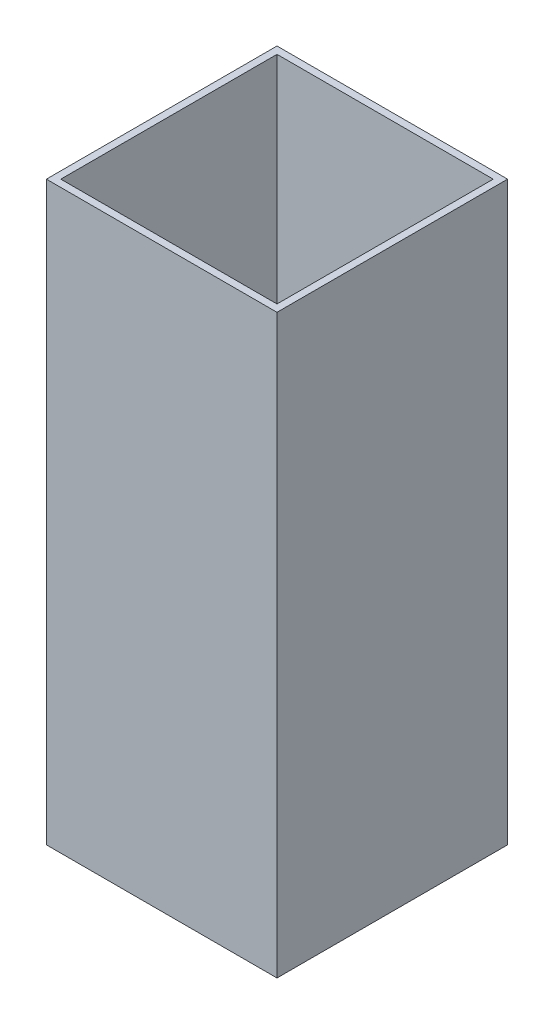
ISO-10303-21;
HEADER;
FILE_DESCRIPTION(('STEP AP214'),'2;1');
FILE_NAME('part.step','',(''),(''),'','','');
FILE_SCHEMA(('AUTOMOTIVE_DESIGN { 1 0 10303 214 1 1 1 1 }'));
ENDSEC;
DATA;
#1=APPLICATION_CONTEXT('core data for automotive mechanical design processes');
#2=APPLICATION_PROTOCOL_DEFINITION('international standard','automotive_design',2000,#1);
#3=PRODUCT_CONTEXT('',#1,'mechanical');
#4=PRODUCT('Part','Part','',(#3));
#5=PRODUCT_RELATED_PRODUCT_CATEGORY('part','',(#4));
#6=PRODUCT_DEFINITION_FORMATION('','',#4);
#7=PRODUCT_DEFINITION_CONTEXT('part definition',#1,'design');
#8=PRODUCT_DEFINITION('design','',#6,#7);
#9=PRODUCT_DEFINITION_SHAPE('','',#8);
#10=(LENGTH_UNIT() NAMED_UNIT(*) SI_UNIT(.MILLI.,.METRE.));
#11=(NAMED_UNIT(*) PLANE_ANGLE_UNIT() SI_UNIT($,.RADIAN.));
#12=(NAMED_UNIT(*) SI_UNIT($,.STERADIAN.) SOLID_ANGLE_UNIT());
#13=UNCERTAINTY_MEASURE_WITH_UNIT(LENGTH_MEASURE(1.E-05),#10,'distance_accuracy_value','');
#14=(GEOMETRIC_REPRESENTATION_CONTEXT(3) GLOBAL_UNCERTAINTY_ASSIGNED_CONTEXT((#13)) GLOBAL_UNIT_ASSIGNED_CONTEXT((#10,
#11,#12)) REPRESENTATION_CONTEXT('',''));
#15=CARTESIAN_POINT('',(0.,0.,0.));
#16=DIRECTION('',(0.,0.,1.));
#17=DIRECTION('',(1.,0.,0.));
#18=AXIS2_PLACEMENT_3D('',#15,#16,#17);
#19=CARTESIAN_POINT('',(0.,40.,0.));
#20=DIRECTION('',(0.,1.,0.));
#21=DIRECTION('',(0.,0.,1.));
#22=AXIS2_PLACEMENT_3D('',#19,#20,#21);
#23=PLANE('',#22);
#24=DIRECTION('',(-1.,0.,0.));
#25=VECTOR('',#24,1.);
#26=CARTESIAN_POINT('',(16.,40.,-16.));
#27=LINE('',#26,#25);
#28=CARTESIAN_POINT('',(16.,40.,-16.));
#29=VERTEX_POINT('',#28);
#30=CARTESIAN_POINT('',(-16.,40.,-16.));
#31=VERTEX_POINT('',#30);
#32=EDGE_CURVE('E135',#29,#31,#27,.T.);
#33=ORIENTED_EDGE('',*,*,#32,.T.);
#34=DIRECTION('',(0.,0.,1.));
#35=VECTOR('',#34,1.);
#36=CARTESIAN_POINT('',(-16.,40.,-16.));
#37=LINE('',#36,#35);
#38=CARTESIAN_POINT('',(-16.,40.,16.));
#39=VERTEX_POINT('',#38);
#40=EDGE_CURVE('E138',#31,#39,#37,.T.);
#41=ORIENTED_EDGE('',*,*,#40,.T.);
#42=DIRECTION('',(1.,0.,0.));
#43=VECTOR('',#42,1.);
#44=CARTESIAN_POINT('',(16.,40.,16.));
#45=LINE('',#44,#43);
#46=CARTESIAN_POINT('',(16.,40.,16.));
#47=VERTEX_POINT('',#46);
#48=EDGE_CURVE('E141',#39,#47,#45,.T.);
#49=ORIENTED_EDGE('',*,*,#48,.T.);
#50=DIRECTION('',(0.,0.,-1.));
#51=VECTOR('',#50,1.);
#52=CARTESIAN_POINT('',(16.,40.,-16.));
#53=LINE('',#52,#51);
#54=EDGE_CURVE('E143',#47,#29,#53,.T.);
#55=ORIENTED_EDGE('',*,*,#54,.T.);
#56=EDGE_LOOP('',(#33,#41,#49,#55));
#57=FACE_BOUND('',#56,.T.);
#58=DIRECTION('',(1.,0.,0.));
#59=VECTOR('',#58,1.);
#60=CARTESIAN_POINT('',(15.,40.,15.));
#61=LINE('',#60,#59);
#62=CARTESIAN_POINT('',(-15.,40.,15.));
#63=VERTEX_POINT('',#62);
#64=CARTESIAN_POINT('',(15.,40.,15.));
#65=VERTEX_POINT('',#64);
#66=EDGE_CURVE('E107',#63,#65,#61,.T.);
#67=ORIENTED_EDGE('',*,*,#66,.F.);
#68=DIRECTION('',(0.,0.,1.));
#69=VECTOR('',#68,1.);
#70=CARTESIAN_POINT('',(-15.,40.,-15.));
#71=LINE('',#70,#69);
#72=CARTESIAN_POINT('',(-15.,40.,-15.));
#73=VERTEX_POINT('',#72);
#74=EDGE_CURVE('E99',#73,#63,#71,.T.);
#75=ORIENTED_EDGE('',*,*,#74,.F.);
#76=DIRECTION('',(-1.,0.,0.));
#77=VECTOR('',#76,1.);
#78=CARTESIAN_POINT('',(15.,40.,-15.));
#79=LINE('',#78,#77);
#80=CARTESIAN_POINT('',(15.,40.,-15.));
#81=VERTEX_POINT('',#80);
#82=EDGE_CURVE('E121',#81,#73,#79,.T.);
#83=ORIENTED_EDGE('',*,*,#82,.F.);
#84=DIRECTION('',(0.,0.,-1.));
#85=VECTOR('',#84,1.);
#86=CARTESIAN_POINT('',(15.,40.,-15.));
#87=LINE('',#86,#85);
#88=EDGE_CURVE('E119',#65,#81,#87,.T.);
#89=ORIENTED_EDGE('',*,*,#88,.F.);
#90=EDGE_LOOP('',(#67,#75,#83,#89));
#91=FACE_BOUND('',#90,.T.);
#92=ADVANCED_FACE('F34',(#57,#91),#23,.T.);
#93=CARTESIAN_POINT('',(0.,-40.,0.));
#94=DIRECTION('',(0.,1.,0.));
#95=DIRECTION('',(0.,0.,1.));
#96=AXIS2_PLACEMENT_3D('',#93,#94,#95);
#97=PLANE('',#96);
#98=DIRECTION('',(-1.,0.,0.));
#99=VECTOR('',#98,1.);
#100=CARTESIAN_POINT('',(16.,-40.,-16.));
#101=LINE('',#100,#99);
#102=CARTESIAN_POINT('',(16.,-40.,-16.));
#103=VERTEX_POINT('',#102);
#104=CARTESIAN_POINT('',(-16.,-40.,-16.));
#105=VERTEX_POINT('',#104);
#106=EDGE_CURVE('E115',#103,#105,#101,.T.);
#107=ORIENTED_EDGE('',*,*,#106,.F.);
#108=DIRECTION('',(0.,0.,-1.));
#109=VECTOR('',#108,1.);
#110=CARTESIAN_POINT('',(16.,-40.,-16.));
#111=LINE('',#110,#109);
#112=CARTESIAN_POINT('',(16.,-40.,16.));
#113=VERTEX_POINT('',#112);
#114=EDGE_CURVE('E139',#113,#103,#111,.T.);
#115=ORIENTED_EDGE('',*,*,#114,.F.);
#116=DIRECTION('',(1.,0.,0.));
#117=VECTOR('',#116,1.);
#118=CARTESIAN_POINT('',(16.,-40.,16.));
#119=LINE('',#118,#117);
#120=CARTESIAN_POINT('',(-16.,-40.,16.));
#121=VERTEX_POINT('',#120);
#122=EDGE_CURVE('E150',#121,#113,#119,.T.);
#123=ORIENTED_EDGE('',*,*,#122,.F.);
#124=DIRECTION('',(0.,0.,1.));
#125=VECTOR('',#124,1.);
#126=CARTESIAN_POINT('',(-16.,-40.,-16.));
#127=LINE('',#126,#125);
#128=EDGE_CURVE('E148',#105,#121,#127,.T.);
#129=ORIENTED_EDGE('',*,*,#128,.F.);
#130=EDGE_LOOP('',(#107,#115,#123,#129));
#131=FACE_BOUND('',#130,.T.);
#132=DIRECTION('',(0.,0.,1.));
#133=VECTOR('',#132,1.);
#134=CARTESIAN_POINT('',(-15.,-40.,-15.));
#135=LINE('',#134,#133);
#136=CARTESIAN_POINT('',(-15.,-40.,-15.));
#137=VERTEX_POINT('',#136);
#138=CARTESIAN_POINT('',(-15.,-40.,15.));
#139=VERTEX_POINT('',#138);
#140=EDGE_CURVE('E57',#137,#139,#135,.T.);
#141=ORIENTED_EDGE('',*,*,#140,.T.);
#142=DIRECTION('',(1.,0.,0.));
#143=VECTOR('',#142,1.);
#144=CARTESIAN_POINT('',(15.,-40.,15.));
#145=LINE('',#144,#143);
#146=CARTESIAN_POINT('',(15.,-40.,15.));
#147=VERTEX_POINT('',#146);
#148=EDGE_CURVE('E114',#139,#147,#145,.T.);
#149=ORIENTED_EDGE('',*,*,#148,.T.);
#150=DIRECTION('',(0.,0.,-1.));
#151=VECTOR('',#150,1.);
#152=CARTESIAN_POINT('',(15.,-40.,-15.));
#153=LINE('',#152,#151);
#154=CARTESIAN_POINT('',(15.,-40.,-15.));
#155=VERTEX_POINT('',#154);
#156=EDGE_CURVE('E127',#147,#155,#153,.T.);
#157=ORIENTED_EDGE('',*,*,#156,.T.);
#158=DIRECTION('',(-1.,0.,0.));
#159=VECTOR('',#158,1.);
#160=CARTESIAN_POINT('',(15.,-40.,-15.));
#161=LINE('',#160,#159);
#162=EDGE_CURVE('E108',#155,#137,#161,.T.);
#163=ORIENTED_EDGE('',*,*,#162,.T.);
#164=EDGE_LOOP('',(#141,#149,#157,#163));
#165=FACE_BOUND('',#164,.T.);
#166=ADVANCED_FACE('F168',(#131,#165),#97,.F.);
#167=CARTESIAN_POINT('',(16.,40.,-16.));
#168=DIRECTION('',(0.,0.,1.));
#169=DIRECTION('',(1.,0.,0.));
#170=AXIS2_PLACEMENT_3D('',#167,#168,#169);
#171=PLANE('',#170);
#172=ORIENTED_EDGE('',*,*,#106,.T.);
#173=DIRECTION('',(0.,-1.,0.));
#174=VECTOR('',#173,1.);
#175=CARTESIAN_POINT('',(-16.,40.,-16.));
#176=LINE('',#175,#174);
#177=EDGE_CURVE('E11',#31,#105,#176,.T.);
#178=ORIENTED_EDGE('',*,*,#177,.F.);
#179=ORIENTED_EDGE('',*,*,#32,.F.);
#180=DIRECTION('',(0.,-1.,0.));
#181=VECTOR('',#180,1.);
#182=CARTESIAN_POINT('',(16.,40.,-16.));
#183=LINE('',#182,#181);
#184=EDGE_CURVE('E145',#29,#103,#183,.T.);
#185=ORIENTED_EDGE('',*,*,#184,.T.);
#186=EDGE_LOOP('',(#172,#178,#179,#185));
#187=FACE_BOUND('',#186,.T.);
#188=ADVANCED_FACE('F36',(#187),#171,.F.);
#189=CARTESIAN_POINT('',(-16.,40.,-16.));
#190=DIRECTION('',(1.,0.,0.));
#191=DIRECTION('',(0.,0.,-1.));
#192=AXIS2_PLACEMENT_3D('',#189,#190,#191);
#193=PLANE('',#192);
#194=ORIENTED_EDGE('',*,*,#128,.T.);
#195=DIRECTION('',(0.,-1.,0.));
#196=VECTOR('',#195,1.);
#197=CARTESIAN_POINT('',(-16.,40.,16.));
#198=LINE('',#197,#196);
#199=EDGE_CURVE('E42',#39,#121,#198,.T.);
#200=ORIENTED_EDGE('',*,*,#199,.F.);
#201=ORIENTED_EDGE('',*,*,#40,.F.);
#202=ORIENTED_EDGE('',*,*,#177,.T.);
#203=EDGE_LOOP('',(#194,#200,#201,#202));
#204=FACE_BOUND('',#203,.T.);
#205=ADVANCED_FACE('F178',(#204),#193,.F.);
#206=CARTESIAN_POINT('',(16.,40.,16.));
#207=DIRECTION('',(0.,0.,-1.));
#208=DIRECTION('',(-1.,0.,0.));
#209=AXIS2_PLACEMENT_3D('',#206,#207,#208);
#210=PLANE('',#209);
#211=ORIENTED_EDGE('',*,*,#122,.T.);
#212=DIRECTION('',(0.,-1.,0.));
#213=VECTOR('',#212,1.);
#214=CARTESIAN_POINT('',(16.,40.,16.));
#215=LINE('',#214,#213);
#216=EDGE_CURVE('E155',#47,#113,#215,.T.);
#217=ORIENTED_EDGE('',*,*,#216,.F.);
#218=ORIENTED_EDGE('',*,*,#48,.F.);
#219=ORIENTED_EDGE('',*,*,#199,.T.);
#220=EDGE_LOOP('',(#211,#217,#218,#219));
#221=FACE_BOUND('',#220,.T.);
#222=ADVANCED_FACE('F162',(#221),#210,.F.);
#223=CARTESIAN_POINT('',(16.,40.,-16.));
#224=DIRECTION('',(-1.,0.,0.));
#225=DIRECTION('',(0.,0.,1.));
#226=AXIS2_PLACEMENT_3D('',#223,#224,#225);
#227=PLANE('',#226);
#228=ORIENTED_EDGE('',*,*,#114,.T.);
#229=ORIENTED_EDGE('',*,*,#184,.F.);
#230=ORIENTED_EDGE('',*,*,#54,.F.);
#231=ORIENTED_EDGE('',*,*,#216,.T.);
#232=EDGE_LOOP('',(#228,#229,#230,#231));
#233=FACE_BOUND('',#232,.T.);
#234=ADVANCED_FACE('F172',(#233),#227,.F.);
#235=CARTESIAN_POINT('',(-15.,40.,-15.));
#236=DIRECTION('',(1.,0.,0.));
#237=DIRECTION('',(0.,0.,-1.));
#238=AXIS2_PLACEMENT_3D('',#235,#236,#237);
#239=PLANE('',#238);
#240=ORIENTED_EDGE('',*,*,#140,.F.);
#241=DIRECTION('',(0.,-1.,0.));
#242=VECTOR('',#241,1.);
#243=CARTESIAN_POINT('',(-15.,40.,-15.));
#244=LINE('',#243,#242);
#245=EDGE_CURVE('E103',#73,#137,#244,.T.);
#246=ORIENTED_EDGE('',*,*,#245,.F.);
#247=ORIENTED_EDGE('',*,*,#74,.T.);
#248=DIRECTION('',(0.,-1.,0.));
#249=VECTOR('',#248,1.);
#250=CARTESIAN_POINT('',(-15.,40.,15.));
#251=LINE('',#250,#249);
#252=EDGE_CURVE('E102',#63,#139,#251,.T.);
#253=ORIENTED_EDGE('',*,*,#252,.T.);
#254=EDGE_LOOP('',(#240,#246,#247,#253));
#255=FACE_BOUND('',#254,.T.);
#256=ADVANCED_FACE('F101',(#255),#239,.T.);
#257=CARTESIAN_POINT('',(15.,40.,15.));
#258=DIRECTION('',(0.,0.,-1.));
#259=DIRECTION('',(-1.,0.,0.));
#260=AXIS2_PLACEMENT_3D('',#257,#258,#259);
#261=PLANE('',#260);
#262=ORIENTED_EDGE('',*,*,#148,.F.);
#263=ORIENTED_EDGE('',*,*,#252,.F.);
#264=ORIENTED_EDGE('',*,*,#66,.T.);
#265=DIRECTION('',(0.,-1.,0.));
#266=VECTOR('',#265,1.);
#267=CARTESIAN_POINT('',(15.,40.,15.));
#268=LINE('',#267,#266);
#269=EDGE_CURVE('E116',#65,#147,#268,.T.);
#270=ORIENTED_EDGE('',*,*,#269,.T.);
#271=EDGE_LOOP('',(#262,#263,#264,#270));
#272=FACE_BOUND('',#271,.T.);
#273=ADVANCED_FACE('F111',(#272),#261,.T.);
#274=CARTESIAN_POINT('',(15.,40.,-15.));
#275=DIRECTION('',(-1.,0.,0.));
#276=DIRECTION('',(0.,0.,1.));
#277=AXIS2_PLACEMENT_3D('',#274,#275,#276);
#278=PLANE('',#277);
#279=ORIENTED_EDGE('',*,*,#156,.F.);
#280=ORIENTED_EDGE('',*,*,#269,.F.);
#281=ORIENTED_EDGE('',*,*,#88,.T.);
#282=DIRECTION('',(0.,-1.,0.));
#283=VECTOR('',#282,1.);
#284=CARTESIAN_POINT('',(15.,40.,-15.));
#285=LINE('',#284,#283);
#286=EDGE_CURVE('E49',#81,#155,#285,.T.);
#287=ORIENTED_EDGE('',*,*,#286,.T.);
#288=EDGE_LOOP('',(#279,#280,#281,#287));
#289=FACE_BOUND('',#288,.T.);
#290=ADVANCED_FACE('F201',(#289),#278,.T.);
#291=CARTESIAN_POINT('',(15.,40.,-15.));
#292=DIRECTION('',(0.,0.,1.));
#293=DIRECTION('',(1.,0.,0.));
#294=AXIS2_PLACEMENT_3D('',#291,#292,#293);
#295=PLANE('',#294);
#296=ORIENTED_EDGE('',*,*,#162,.F.);
#297=ORIENTED_EDGE('',*,*,#286,.F.);
#298=ORIENTED_EDGE('',*,*,#82,.T.);
#299=ORIENTED_EDGE('',*,*,#245,.T.);
#300=EDGE_LOOP('',(#296,#297,#298,#299));
#301=FACE_BOUND('',#300,.T.);
#302=ADVANCED_FACE('F205',(#301),#295,.T.);
#303=CLOSED_SHELL('',(#92,#166,#188,#205,#222,#234,#256,#273,#290,#302));
#304=MANIFOLD_SOLID_BREP('B2',#303);
#305=ADVANCED_BREP_SHAPE_REPRESENTATION('',(#18,#304),#14);
#306=SHAPE_DEFINITION_REPRESENTATION(#9,#305);
ENDSEC;
END-ISO-10303-21;
